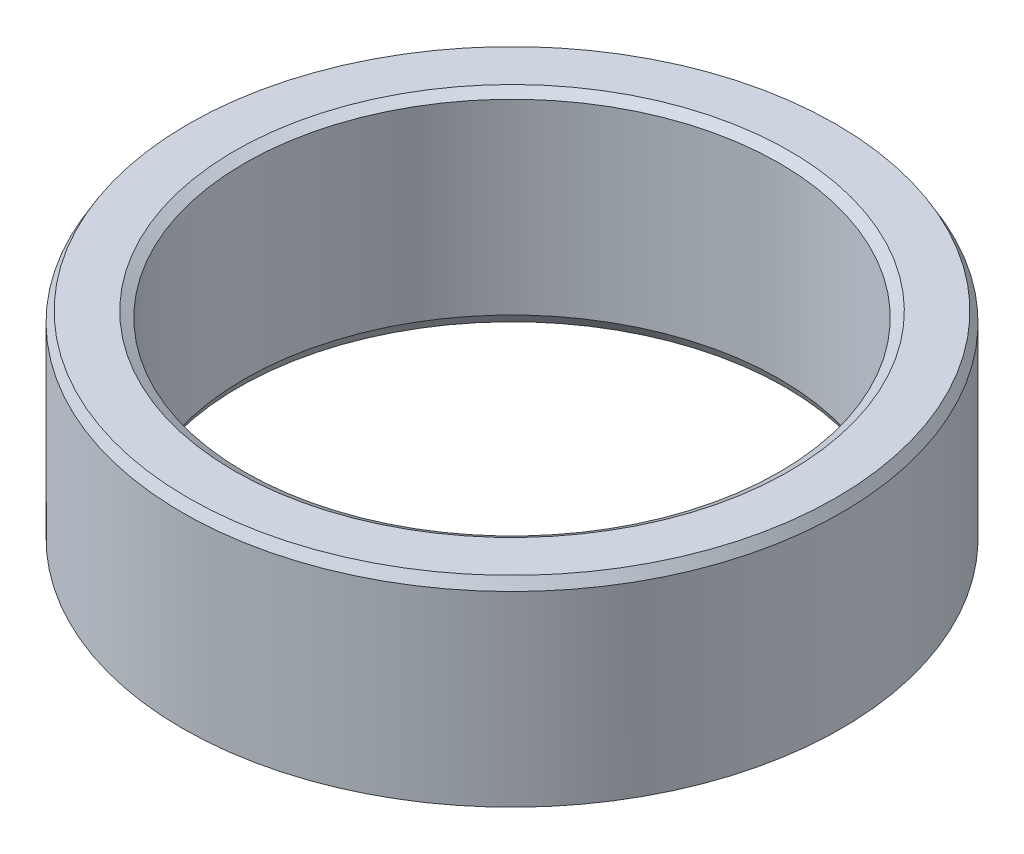
ISO-10303-21;
HEADER;
FILE_DESCRIPTION(('STEP AP214'),'2;1');
FILE_NAME('part.step','',(''),(''),'','','');
FILE_SCHEMA(('AUTOMOTIVE_DESIGN { 1 0 10303 214 1 1 1 1 }'));
ENDSEC;
DATA;
#1=APPLICATION_CONTEXT('core data for automotive mechanical design processes');
#2=APPLICATION_PROTOCOL_DEFINITION('international standard','automotive_design',2000,#1);
#3=PRODUCT_CONTEXT('',#1,'mechanical');
#4=PRODUCT('Part','Part','',(#3));
#5=PRODUCT_RELATED_PRODUCT_CATEGORY('part','',(#4));
#6=PRODUCT_DEFINITION_FORMATION('','',#4);
#7=PRODUCT_DEFINITION_CONTEXT('part definition',#1,'design');
#8=PRODUCT_DEFINITION('design','',#6,#7);
#9=PRODUCT_DEFINITION_SHAPE('','',#8);
#10=(LENGTH_UNIT() NAMED_UNIT(*) SI_UNIT(.MILLI.,.METRE.));
#11=(NAMED_UNIT(*) PLANE_ANGLE_UNIT() SI_UNIT($,.RADIAN.));
#12=(NAMED_UNIT(*) SI_UNIT($,.STERADIAN.) SOLID_ANGLE_UNIT());
#13=UNCERTAINTY_MEASURE_WITH_UNIT(LENGTH_MEASURE(1.E-05),#10,'distance_accuracy_value','');
#14=(GEOMETRIC_REPRESENTATION_CONTEXT(3) GLOBAL_UNCERTAINTY_ASSIGNED_CONTEXT((#13)) GLOBAL_UNIT_ASSIGNED_CONTEXT((#10,
#11,#12)) REPRESENTATION_CONTEXT('',''));
#15=CARTESIAN_POINT('',(0.,0.,0.));
#16=DIRECTION('',(0.,0.,1.));
#17=DIRECTION('',(1.,0.,0.));
#18=AXIS2_PLACEMENT_3D('',#15,#16,#17);
#19=CARTESIAN_POINT('',(0.,26.1180070944708,0.));
#20=DIRECTION('',(0.,-1.,0.));
#21=DIRECTION('',(0.,0.,-1.));
#22=AXIS2_PLACEMENT_3D('',#19,#20,#21);
#23=CYLINDRICAL_SURFACE('',#22,42.5);
#24=CARTESIAN_POINT('',(0.,0.74086424180498,0.));
#25=DIRECTION('',(0.,1.,0.));
#26=DIRECTION('',(0.,0.,1.));
#27=AXIS2_PLACEMENT_3D('',#24,#25,#26);
#28=CIRCLE('',#27,42.5);
#29=CARTESIAN_POINT('',(0.,0.740864241804976,-42.5));
#30=VERTEX_POINT('',#29);
#31=EDGE_CURVE('E10',#30,#30,#28,.T.);
#32=CARTESIAN_POINT('',(0.,24.8347925861537,0.));
#33=DIRECTION('',(0.,1.,0.));
#34=DIRECTION('',(0.,0.,1.));
#35=AXIS2_PLACEMENT_3D('',#32,#33,#34);
#36=CIRCLE('',#35,42.5);
#37=CARTESIAN_POINT('',(0.,24.8347925861537,-42.5));
#38=VERTEX_POINT('',#37);
#39=EDGE_CURVE('E50',#38,#38,#36,.F.);
#40=CARTESIAN_POINT('',(0.,0.740864241804976,-42.5));
#41=CARTESIAN_POINT('',(0.,0.991842662058608,-42.5));
#42=CARTESIAN_POINT('',(0.,1.24282108231224,-42.5));
#43=CARTESIAN_POINT('',(0.,1.7447779228195,-42.5));
#44=CARTESIAN_POINT('',(0.,1.99575634307314,-42.5));
#45=CARTESIAN_POINT('',(0.,2.4977131835804,-42.5));
#46=CARTESIAN_POINT('',(0.,2.74869160383403,-42.5));
#47=CARTESIAN_POINT('',(0.,3.2506484443413,-42.5));
#48=CARTESIAN_POINT('',(0.,3.50162686459493,-42.5));
#49=CARTESIAN_POINT('',(0.,4.00358370510219,-42.5));
#50=CARTESIAN_POINT('',(0.,4.25456212535582,-42.5));
#51=CARTESIAN_POINT('',(0.,4.75651896586309,-42.5));
#52=CARTESIAN_POINT('',(0.,5.00749738611672,-42.5));
#53=CARTESIAN_POINT('',(0.,5.50945422662399,-42.5));
#54=CARTESIAN_POINT('',(0.,5.76043264687762,-42.5));
#55=CARTESIAN_POINT('',(0.,6.26238948738488,-42.5));
#56=CARTESIAN_POINT('',(0.,6.51336790763851,-42.5));
#57=CARTESIAN_POINT('',(0.,7.01532474814578,-42.5));
#58=CARTESIAN_POINT('',(0.,7.26630316839941,-42.5));
#59=CARTESIAN_POINT('',(0.,7.76826000890667,-42.5));
#60=CARTESIAN_POINT('',(0.,8.01923842916031,-42.5));
#61=CARTESIAN_POINT('',(0.,8.52119526966757,-42.5));
#62=CARTESIAN_POINT('',(0.,8.7721736899212,-42.5));
#63=CARTESIAN_POINT('',(0.,9.27413053042847,-42.5));
#64=CARTESIAN_POINT('',(0.,9.5251089506821,-42.5));
#65=CARTESIAN_POINT('',(0.,10.0270657911894,-42.5));
#66=CARTESIAN_POINT('',(0.,10.278044211443,-42.5));
#67=CARTESIAN_POINT('',(0.,10.7800010519503,-42.5));
#68=CARTESIAN_POINT('',(0.,11.0309794722039,-42.5));
#69=CARTESIAN_POINT('',(0.,11.5329363127112,-42.5));
#70=CARTESIAN_POINT('',(0.,11.7839147329648,-42.5));
#71=CARTESIAN_POINT('',(0.,12.2858715734721,-42.5));
#72=CARTESIAN_POINT('',(0.,12.5368499937257,-42.5));
#73=CARTESIAN_POINT('',(0.,13.0388068342329,-42.5));
#74=CARTESIAN_POINT('',(0.,13.2897852544866,-42.5));
#75=CARTESIAN_POINT('',(0.,13.7917420949938,-42.5));
#76=CARTESIAN_POINT('',(0.,14.0427205152475,-42.5));
#77=CARTESIAN_POINT('',(0.,14.5446773557547,-42.5));
#78=CARTESIAN_POINT('',(0.,14.7956557760084,-42.5));
#79=CARTESIAN_POINT('',(0.,15.2976126165156,-42.5));
#80=CARTESIAN_POINT('',(0.,15.5485910367693,-42.5));
#81=CARTESIAN_POINT('',(0.,16.0505478772765,-42.5));
#82=CARTESIAN_POINT('',(0.,16.3015262975302,-42.5));
#83=CARTESIAN_POINT('',(0.,16.8034831380374,-42.5));
#84=CARTESIAN_POINT('',(0.,17.0544615582911,-42.5));
#85=CARTESIAN_POINT('',(0.,17.5564183987983,-42.5));
#86=CARTESIAN_POINT('',(0.,17.807396819052,-42.5));
#87=CARTESIAN_POINT('',(0.,18.3093536595592,-42.5));
#88=CARTESIAN_POINT('',(0.,18.5603320798128,-42.5));
#89=CARTESIAN_POINT('',(0.,19.0622889203201,-42.5));
#90=CARTESIAN_POINT('',(0.,19.3132673405737,-42.5));
#91=CARTESIAN_POINT('',(0.,19.815224181081,-42.5));
#92=CARTESIAN_POINT('',(0.,20.0662026013346,-42.5));
#93=CARTESIAN_POINT('',(0.,20.5681594418419,-42.5));
#94=CARTESIAN_POINT('',(0.,20.8191378620955,-42.5));
#95=CARTESIAN_POINT('',(0.,21.3210947026028,-42.5));
#96=CARTESIAN_POINT('',(0.,21.5720731228564,-42.5));
#97=CARTESIAN_POINT('',(0.,22.0740299633637,-42.5));
#98=CARTESIAN_POINT('',(0.,22.3250083836173,-42.5));
#99=CARTESIAN_POINT('',(0.,22.8269652241246,-42.5));
#100=CARTESIAN_POINT('',(0.,23.0779436443782,-42.5));
#101=CARTESIAN_POINT('',(0.,23.5799004848855,-42.5));
#102=CARTESIAN_POINT('',(0.,23.8308789051391,-42.5));
#103=CARTESIAN_POINT('',(0.,24.3328357456464,-42.5));
#104=CARTESIAN_POINT('',(0.,24.5838141659,-42.5));
#105=CARTESIAN_POINT('',(0.,24.8347925861537,-42.5));
#106=B_SPLINE_CURVE_WITH_KNOTS('',3,(#40,#41,#42,#43,#44,#45,#46,#47,#48,#49,#50,#51,#52,#53,
#54,#55,#56,#57,#58,#59,#60,#61,#62,#63,#64,#65,#66,#67,#68,#69,#70,#71,#72,#73,#74,#75,#76,#77,
#78,#79,#80,#81,#82,#83,#84,#85,#86,#87,#88,#89,#90,#91,#92,#93,#94,#95,#96,#97,#98,#99,#100,
#101,#102,#103,#104,#105),.UNSPECIFIED.,.F.,.F.,(4,2,2,2,2,2,2,2,2,2,2,2,2,2,2,2,2,2,2,2,2,2,2,
2,2,2,2,2,2,2,2,2,4),(0.,0.752935260760895,1.50587052152179,2.25880578228269,3.01174104304358,
3.76467630380448,4.51761156456538,5.27054682532627,6.02348208608717,6.77641734684806,
7.52935260760896,8.28228786836986,9.03522312913076,9.78815838989165,10.5410936506525,
11.2940289114134,12.0469641721743,12.7998994329352,13.5528346936961,14.305769954457,
15.0587052152179,15.8116404759788,16.5645757367397,17.3175109975006,18.0704462582615,
18.8233815190224,19.5763167797833,20.3292520405442,21.0821873013051,21.835122562066,
22.5880578228269,23.3409930835878,24.0939283443487),.UNSPECIFIED.);
#107=EDGE_CURVE('BSEAM39',#30,#38,#106,.T.);
#108=ORIENTED_EDGE('',*,*,#31,.T.);
#109=ORIENTED_EDGE('',*,*,#39,.T.);
#110=ORIENTED_EDGE('',*,*,#107,.T.);
#111=ORIENTED_EDGE('',*,*,#107,.F.);
#112=EDGE_LOOP('',(#108,#110,#109,#111));
#113=FACE_BOUND('',#112,.T.);
#114=ADVANCED_FACE('F39',(#113),#23,.T.);
#115=CARTESIAN_POINT('',(0.,26.1180070944708,0.));
#116=DIRECTION('',(0.,1.,0.));
#117=DIRECTION('',(0.,0.,1.));
#118=AXIS2_PLACEMENT_3D('',#115,#116,#117);
#119=PLANE('',#118);
#120=CARTESIAN_POINT('',(0.,26.1180070944708,0.));
#121=DIRECTION('',(0.,1.,0.));
#122=DIRECTION('',(0.,0.,1.));
#123=AXIS2_PLACEMENT_3D('',#120,#121,#122);
#124=CIRCLE('',#123,35.7767400449103);
#125=CARTESIAN_POINT('',(0.,26.1180070944708,35.7767400449103));
#126=VERTEX_POINT('',#125);
#127=EDGE_CURVE('E58',#126,#126,#124,.F.);
#128=ORIENTED_EDGE('',*,*,#127,.T.);
#129=EDGE_LOOP('',(#128));
#130=FACE_BOUND('',#129,.T.);
#131=CARTESIAN_POINT('',(0.,26.1180070944708,0.));
#132=DIRECTION('',(0.,1.,0.));
#133=DIRECTION('',(0.,0.,1.));
#134=AXIS2_PLACEMENT_3D('',#131,#132,#133);
#135=CIRCLE('',#134,41.7591357581951);
#136=CARTESIAN_POINT('',(0.,26.1180070944708,41.7591357581951));
#137=VERTEX_POINT('',#136);
#138=EDGE_CURVE('E61',#137,#137,#135,.T.);
#139=ORIENTED_EDGE('',*,*,#138,.T.);
#140=EDGE_LOOP('',(#139));
#141=FACE_BOUND('',#140,.T.);
#142=ADVANCED_FACE('F88',(#130,#141),#119,.T.);
#143=CARTESIAN_POINT('',(0.,0.,0.));
#144=DIRECTION('',(0.,1.,0.));
#145=DIRECTION('',(0.,0.,1.));
#146=AXIS2_PLACEMENT_3D('',#143,#144,#145);
#147=PLANE('',#146);
#148=CARTESIAN_POINT('',(0.,0.,0.));
#149=DIRECTION('',(0.,1.,0.));
#150=DIRECTION('',(0.,0.,1.));
#151=AXIS2_PLACEMENT_3D('',#148,#149,#150);
#152=CIRCLE('',#151,35.234389778398);
#153=CARTESIAN_POINT('',(0.,0.,35.234389778398));
#154=VERTEX_POINT('',#153);
#155=EDGE_CURVE('E51',#154,#154,#152,.T.);
#156=ORIENTED_EDGE('',*,*,#155,.T.);
#157=EDGE_LOOP('',(#156));
#158=FACE_BOUND('',#157,.T.);
#159=CARTESIAN_POINT('',(0.,0.,0.));
#160=DIRECTION('',(0.,1.,0.));
#161=DIRECTION('',(0.,0.,1.));
#162=AXIS2_PLACEMENT_3D('',#159,#160,#161);
#163=CIRCLE('',#162,41.2167854916828);
#164=CARTESIAN_POINT('',(0.,0.,41.2167854916828));
#165=VERTEX_POINT('',#164);
#166=EDGE_CURVE('E54',#165,#165,#163,.F.);
#167=ORIENTED_EDGE('',*,*,#166,.T.);
#168=EDGE_LOOP('',(#167));
#169=FACE_BOUND('',#168,.T.);
#170=ADVANCED_FACE('F83',(#158,#169),#147,.F.);
#171=CARTESIAN_POINT('',(0.,26.1180070944708,0.));
#172=DIRECTION('',(0.,-1.,0.));
#173=DIRECTION('',(0.,0.,-1.));
#174=AXIS2_PLACEMENT_3D('',#171,#172,#173);
#175=CYLINDRICAL_SURFACE('',#174,34.4935255365931);
#176=CARTESIAN_POINT('',(0.,25.3771428526658,0.));
#177=DIRECTION('',(0.,1.,0.));
#178=DIRECTION('',(0.,0.,1.));
#179=AXIS2_PLACEMENT_3D('',#176,#177,#178);
#180=CIRCLE('',#179,34.4935255365931);
#181=CARTESIAN_POINT('',(0.,25.3771428526658,-34.4935255365931));
#182=VERTEX_POINT('',#181);
#183=EDGE_CURVE('E67',#182,#182,#180,.T.);
#184=CARTESIAN_POINT('',(0.,1.28321450831707,0.));
#185=DIRECTION('',(0.,1.,0.));
#186=DIRECTION('',(0.,0.,1.));
#187=AXIS2_PLACEMENT_3D('',#184,#185,#186);
#188=CIRCLE('',#187,34.4935255365931);
#189=CARTESIAN_POINT('',(0.,1.28321450831707,-34.4935255365931));
#190=VERTEX_POINT('',#189);
#191=EDGE_CURVE('E69',#190,#190,#188,.F.);
#192=CARTESIAN_POINT('',(0.,25.3771428526658,-34.4935255365931));
#193=CARTESIAN_POINT('',(0.,25.1261644324122,-34.4935255365931));
#194=CARTESIAN_POINT('',(0.,24.8751860121585,-34.4935255365931));
#195=CARTESIAN_POINT('',(0.,24.3732291716513,-34.4935255365931));
#196=CARTESIAN_POINT('',(0.,24.1222507513976,-34.4935255365931));
#197=CARTESIAN_POINT('',(0.,23.6202939108904,-34.4935255365931));
#198=CARTESIAN_POINT('',(0.,23.3693154906367,-34.4935255365931));
#199=CARTESIAN_POINT('',(0.,22.8673586501295,-34.4935255365931));
#200=CARTESIAN_POINT('',(0.,22.6163802298758,-34.4935255365931));
#201=CARTESIAN_POINT('',(0.,22.1144233893686,-34.4935255365931));
#202=CARTESIAN_POINT('',(0.,21.8634449691149,-34.4935255365931));
#203=CARTESIAN_POINT('',(0.,21.3614881286077,-34.4935255365931));
#204=CARTESIAN_POINT('',(0.,21.110509708354,-34.4935255365931));
#205=CARTESIAN_POINT('',(0.,20.6085528678468,-34.4935255365931));
#206=CARTESIAN_POINT('',(0.,20.3575744475931,-34.4935255365931));
#207=CARTESIAN_POINT('',(0.,19.8556176070859,-34.4935255365931));
#208=CARTESIAN_POINT('',(0.,19.6046391868322,-34.4935255365931));
#209=CARTESIAN_POINT('',(0.,19.102682346325,-34.4935255365931));
#210=CARTESIAN_POINT('',(0.,18.8517039260713,-34.4935255365931));
#211=CARTESIAN_POINT('',(0.,18.3497470855641,-34.4935255365931));
#212=CARTESIAN_POINT('',(0.,18.0987686653105,-34.4935255365931));
#213=CARTESIAN_POINT('',(0.,17.5968118248032,-34.4935255365931));
#214=CARTESIAN_POINT('',(0.,17.3458334045496,-34.4935255365931));
#215=CARTESIAN_POINT('',(0.,16.8438765640423,-34.4935255365931));
#216=CARTESIAN_POINT('',(0.,16.5928981437887,-34.4935255365931));
#217=CARTESIAN_POINT('',(0.,16.0909413032814,-34.4935255365931));
#218=CARTESIAN_POINT('',(0.,15.8399628830278,-34.4935255365931));
#219=CARTESIAN_POINT('',(0.,15.3380060425205,-34.4935255365931));
#220=CARTESIAN_POINT('',(0.,15.0870276222669,-34.4935255365931));
#221=CARTESIAN_POINT('',(0.,14.5850707817596,-34.4935255365931));
#222=CARTESIAN_POINT('',(0.,14.334092361506,-34.4935255365931));
#223=CARTESIAN_POINT('',(0.,13.8321355209987,-34.4935255365931));
#224=CARTESIAN_POINT('',(0.,13.5811571007451,-34.4935255365931));
#225=CARTESIAN_POINT('',(0.,13.0792002602378,-34.4935255365931));
#226=CARTESIAN_POINT('',(0.,12.8282218399842,-34.4935255365931));
#227=CARTESIAN_POINT('',(0.,12.3262649994769,-34.4935255365931));
#228=CARTESIAN_POINT('',(0.,12.0752865792233,-34.4935255365931));
#229=CARTESIAN_POINT('',(0.,11.573329738716,-34.4935255365931));
#230=CARTESIAN_POINT('',(0.,11.3223513184624,-34.4935255365931));
#231=CARTESIAN_POINT('',(0.,10.8203944779551,-34.4935255365931));
#232=CARTESIAN_POINT('',(0.,10.5694160577015,-34.4935255365931));
#233=CARTESIAN_POINT('',(0.,10.0674592171942,-34.4935255365931));
#234=CARTESIAN_POINT('',(0.,9.81648079694057,-34.4935255365931));
#235=CARTESIAN_POINT('',(0.,9.31452395643331,-34.4935255365931));
#236=CARTESIAN_POINT('',(0.,9.06354553617968,-34.4935255365931));
#237=CARTESIAN_POINT('',(0.,8.56158869567241,-34.4935255365931));
#238=CARTESIAN_POINT('',(0.,8.31061027541878,-34.4935255365931));
#239=CARTESIAN_POINT('',(0.,7.80865343491152,-34.4935255365931));
#240=CARTESIAN_POINT('',(0.,7.55767501465788,-34.4935255365931));
#241=CARTESIAN_POINT('',(0.,7.05571817415062,-34.4935255365931));
#242=CARTESIAN_POINT('',(0.,6.80473975389699,-34.4935255365931));
#243=CARTESIAN_POINT('',(0.,6.30278291338972,-34.4935255365931));
#244=CARTESIAN_POINT('',(0.,6.05180449313609,-34.4935255365931));
#245=CARTESIAN_POINT('',(0.,5.54984765262882,-34.4935255365931));
#246=CARTESIAN_POINT('',(0.,5.29886923237519,-34.4935255365931));
#247=CARTESIAN_POINT('',(0.,4.79691239186792,-34.4935255365931));
#248=CARTESIAN_POINT('',(0.,4.54593397161429,-34.4935255365931));
#249=CARTESIAN_POINT('',(0.,4.04397713110703,-34.4935255365931));
#250=CARTESIAN_POINT('',(0.,3.7929987108534,-34.4935255365931));
#251=CARTESIAN_POINT('',(0.,3.29104187034613,-34.4935255365931));
#252=CARTESIAN_POINT('',(0.,3.0400634500925,-34.4935255365931));
#253=CARTESIAN_POINT('',(0.,2.53810660958523,-34.4935255365931));
#254=CARTESIAN_POINT('',(0.,2.2871281893316,-34.4935255365931));
#255=CARTESIAN_POINT('',(0.,1.78517134882434,-34.4935255365931));
#256=CARTESIAN_POINT('',(0.,1.5341929285707,-34.4935255365931));
#257=CARTESIAN_POINT('',(0.,1.28321450831707,-34.4935255365931));
#258=B_SPLINE_CURVE_WITH_KNOTS('',3,(#192,#193,#194,#195,#196,#197,#198,#199,#200,#201,#202,
#203,#204,#205,#206,#207,#208,#209,#210,#211,#212,#213,#214,#215,#216,#217,#218,#219,#220,#221,
#222,#223,#224,#225,#226,#227,#228,#229,#230,#231,#232,#233,#234,#235,#236,#237,#238,#239,#240,
#241,#242,#243,#244,#245,#246,#247,#248,#249,#250,#251,#252,#253,#254,#255,#256,#257),
.UNSPECIFIED.,.F.,.F.,(4,2,2,2,2,2,2,2,2,2,2,2,2,2,2,2,2,2,2,2,2,2,2,2,2,2,2,2,2,2,2,2,4),(0.,
0.752935260760895,1.50587052152179,2.25880578228269,3.01174104304359,3.76467630380449,
4.51761156456538,5.27054682532628,6.02348208608718,6.77641734684807,7.52935260760897,
8.28228786836987,9.03522312913077,9.78815838989166,10.5410936506526,11.2940289114135,
12.0469641721744,12.7998994329353,13.5528346936962,14.3057699544571,15.0587052152179,
15.8116404759788,16.5645757367397,17.3175109975006,18.0704462582615,18.8233815190224,
19.5763167797833,20.3292520405442,21.0821873013051,21.835122562066,22.5880578228269,
23.3409930835878,24.0939283443487),.UNSPECIFIED.);
#259=EDGE_CURVE('BSEAM71',#182,#190,#258,.T.);
#260=ORIENTED_EDGE('',*,*,#183,.T.);
#261=ORIENTED_EDGE('',*,*,#191,.T.);
#262=ORIENTED_EDGE('',*,*,#259,.T.);
#263=ORIENTED_EDGE('',*,*,#259,.F.);
#264=EDGE_LOOP('',(#260,#262,#261,#263));
#265=FACE_BOUND('',#264,.T.);
#266=ADVANCED_FACE('F71',(#265),#175,.F.);
#267=CARTESIAN_POINT('',(0.,25.3771428526658,0.));
#268=DIRECTION('',(0.,1.,0.));
#269=DIRECTION('',(0.,0.,1.));
#270=AXIS2_PLACEMENT_3D('',#267,#268,#269);
#271=CONICAL_SURFACE('',#270,34.4935255365931,1.0471975511966);
#272=ORIENTED_EDGE('',*,*,#127,.F.);
#273=EDGE_LOOP('',(#272));
#274=FACE_BOUND('',#273,.T.);
#275=ORIENTED_EDGE('',*,*,#183,.F.);
#276=EDGE_LOOP('',(#275));
#277=FACE_BOUND('',#276,.T.);
#278=ADVANCED_FACE('F77',(#274,#277),#271,.F.);
#279=CARTESIAN_POINT('',(0.,0.,0.));
#280=DIRECTION('',(0.,-1.,0.));
#281=DIRECTION('',(0.,0.,-1.));
#282=AXIS2_PLACEMENT_3D('',#279,#280,#281);
#283=CONICAL_SURFACE('',#282,35.234389778398,0.523598775598291);
#284=ORIENTED_EDGE('',*,*,#191,.F.);
#285=EDGE_LOOP('',(#284));
#286=FACE_BOUND('',#285,.T.);
#287=ORIENTED_EDGE('',*,*,#155,.F.);
#288=EDGE_LOOP('',(#287));
#289=FACE_BOUND('',#288,.T.);
#290=ADVANCED_FACE('F73',(#286,#289),#283,.F.);
#291=CARTESIAN_POINT('',(0.,0.74086424180498,0.));
#292=DIRECTION('',(0.,1.,0.));
#293=DIRECTION('',(0.,0.,1.));
#294=AXIS2_PLACEMENT_3D('',#291,#292,#293);
#295=CONICAL_SURFACE('',#294,42.5,1.0471975511966);
#296=ORIENTED_EDGE('',*,*,#166,.F.);
#297=EDGE_LOOP('',(#296));
#298=FACE_BOUND('',#297,.T.);
#299=ORIENTED_EDGE('',*,*,#31,.F.);
#300=EDGE_LOOP('',(#299));
#301=FACE_BOUND('',#300,.T.);
#302=ADVANCED_FACE('F76',(#298,#301),#295,.T.);
#303=CARTESIAN_POINT('',(0.,26.1180070944708,0.));
#304=DIRECTION('',(0.,-1.,0.));
#305=DIRECTION('',(0.,0.,-1.));
#306=AXIS2_PLACEMENT_3D('',#303,#304,#305);
#307=CONICAL_SURFACE('',#306,41.7591357581951,0.523598775598294);
#308=ORIENTED_EDGE('',*,*,#39,.F.);
#309=EDGE_LOOP('',(#308));
#310=FACE_BOUND('',#309,.T.);
#311=ORIENTED_EDGE('',*,*,#138,.F.);
#312=EDGE_LOOP('',(#311));
#313=FACE_BOUND('',#312,.T.);
#314=ADVANCED_FACE('F45',(#310,#313),#307,.T.);
#315=CLOSED_SHELL('',(#114,#142,#170,#266,#278,#290,#302,#314));
#316=MANIFOLD_SOLID_BREP('B2',#315);
#317=ADVANCED_BREP_SHAPE_REPRESENTATION('',(#18,#316),#14);
#318=SHAPE_DEFINITION_REPRESENTATION(#9,#317);
ENDSEC;
END-ISO-10303-21;
